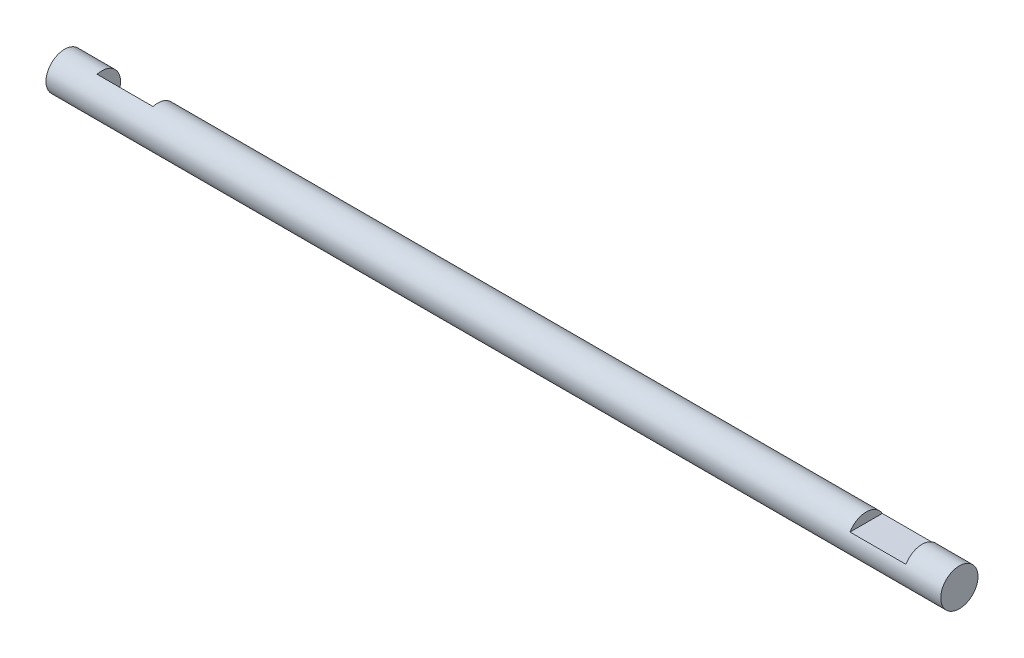
ISO-10303-21;
HEADER;
FILE_DESCRIPTION(('STEP AP214'),'2;1');
FILE_NAME('part.step','',(''),(''),'','','');
FILE_SCHEMA(('AUTOMOTIVE_DESIGN { 1 0 10303 214 1 1 1 1 }'));
ENDSEC;
DATA;
#1=APPLICATION_CONTEXT('core data for automotive mechanical design processes');
#2=APPLICATION_PROTOCOL_DEFINITION('international standard','automotive_design',2000,#1);
#3=PRODUCT_CONTEXT('',#1,'mechanical');
#4=PRODUCT('Part','Part','',(#3));
#5=PRODUCT_RELATED_PRODUCT_CATEGORY('part','',(#4));
#6=PRODUCT_DEFINITION_FORMATION('','',#4);
#7=PRODUCT_DEFINITION_CONTEXT('part definition',#1,'design');
#8=PRODUCT_DEFINITION('design','',#6,#7);
#9=PRODUCT_DEFINITION_SHAPE('','',#8);
#10=(LENGTH_UNIT() NAMED_UNIT(*) SI_UNIT(.MILLI.,.METRE.));
#11=(NAMED_UNIT(*) PLANE_ANGLE_UNIT() SI_UNIT($,.RADIAN.));
#12=(NAMED_UNIT(*) SI_UNIT($,.STERADIAN.) SOLID_ANGLE_UNIT());
#13=UNCERTAINTY_MEASURE_WITH_UNIT(LENGTH_MEASURE(1.E-05),#10,'distance_accuracy_value','');
#14=(GEOMETRIC_REPRESENTATION_CONTEXT(3) GLOBAL_UNCERTAINTY_ASSIGNED_CONTEXT((#13)) GLOBAL_UNIT_ASSIGNED_CONTEXT((#10,
#11,#12)) REPRESENTATION_CONTEXT('',''));
#15=CARTESIAN_POINT('',(0.,0.,0.));
#16=DIRECTION('',(0.,0.,1.));
#17=DIRECTION('',(1.,0.,0.));
#18=AXIS2_PLACEMENT_3D('',#15,#16,#17);
#19=CARTESIAN_POINT('',(152.4,0.,0.));
#20=DIRECTION('',(-1.,0.,0.));
#21=DIRECTION('',(0.,0.,1.));
#22=AXIS2_PLACEMENT_3D('',#19,#20,#21);
#23=CYLINDRICAL_SURFACE('',#22,6.35);
#24=CARTESIAN_POINT('',(-152.4,0.,0.));
#25=DIRECTION('',(1.,0.,0.));
#26=DIRECTION('',(0.,0.,-1.));
#27=AXIS2_PLACEMENT_3D('',#24,#25,#26);
#28=CIRCLE('',#27,6.35);
#29=CARTESIAN_POINT('',(-152.4,0.,-6.35));
#30=VERTEX_POINT('',#29);
#31=EDGE_CURVE('E108',#30,#30,#28,.T.);
#32=ORIENTED_EDGE('',*,*,#31,.T.);
#33=EDGE_LOOP('',(#32));
#34=FACE_BOUND('',#33,.T.);
#35=CARTESIAN_POINT('',(152.4,0.,0.));
#36=DIRECTION('',(1.,0.,0.));
#37=DIRECTION('',(0.,0.,-1.));
#38=AXIS2_PLACEMENT_3D('',#35,#36,#37);
#39=CIRCLE('',#38,6.35);
#40=CARTESIAN_POINT('',(152.4,0.,-6.35));
#41=VERTEX_POINT('',#40);
#42=EDGE_CURVE('E107',#41,#41,#39,.T.);
#43=ORIENTED_EDGE('',*,*,#42,.F.);
#44=EDGE_LOOP('',(#43));
#45=FACE_BOUND('',#44,.T.);
#46=DIRECTION('',(-1.,0.,0.));
#47=VECTOR('',#46,1.);
#48=CARTESIAN_POINT('',(152.4,3.175,-5.49926131403118));
#49=LINE('',#48,#47);
#50=CARTESIAN_POINT('',(139.7,3.175,-5.49926131403118));
#51=VERTEX_POINT('',#50);
#52=CARTESIAN_POINT('',(120.65,3.175,-5.49926131403118));
#53=VERTEX_POINT('',#52);
#54=EDGE_CURVE('E97',#51,#53,#49,.T.);
#55=ORIENTED_EDGE('',*,*,#54,.F.);
#56=CARTESIAN_POINT('',(139.7,0.,0.));
#57=DIRECTION('',(1.,0.,0.));
#58=DIRECTION('',(0.,0.,-1.));
#59=AXIS2_PLACEMENT_3D('',#56,#57,#58);
#60=CIRCLE('',#59,6.35);
#61=CARTESIAN_POINT('',(139.7,3.175,5.49926131403118));
#62=VERTEX_POINT('',#61);
#63=EDGE_CURVE('E103',#51,#62,#60,.T.);
#64=ORIENTED_EDGE('',*,*,#63,.T.);
#65=DIRECTION('',(-1.,0.,0.));
#66=VECTOR('',#65,1.);
#67=CARTESIAN_POINT('',(152.4,3.175,5.49926131403118));
#68=LINE('',#67,#66);
#69=CARTESIAN_POINT('',(120.65,3.175,5.49926131403118));
#70=VERTEX_POINT('',#69);
#71=EDGE_CURVE('E99',#70,#62,#68,.F.);
#72=ORIENTED_EDGE('',*,*,#71,.F.);
#73=CARTESIAN_POINT('',(120.65,0.,0.));
#74=DIRECTION('',(-1.,0.,0.));
#75=DIRECTION('',(0.,0.,1.));
#76=AXIS2_PLACEMENT_3D('',#73,#74,#75);
#77=CIRCLE('',#76,6.35);
#78=EDGE_CURVE('E65',#70,#53,#77,.T.);
#79=ORIENTED_EDGE('',*,*,#78,.T.);
#80=EDGE_LOOP('',(#55,#64,#72,#79));
#81=FACE_BOUND('',#80,.T.);
#82=DIRECTION('',(-1.,0.,0.));
#83=VECTOR('',#82,1.);
#84=CARTESIAN_POINT('',(152.4,6.13362899693558,1.64350093640102));
#85=LINE('',#84,#83);
#86=CARTESIAN_POINT('',(-120.65,6.13362899693559,1.64350093640101));
#87=VERTEX_POINT('',#86);
#88=CARTESIAN_POINT('',(-139.7,6.13362899693559,1.64350093640101));
#89=VERTEX_POINT('',#88);
#90=EDGE_CURVE('E13',#87,#89,#85,.T.);
#91=ORIENTED_EDGE('',*,*,#90,.T.);
#92=CARTESIAN_POINT('',(-139.7,0.,0.));
#93=DIRECTION('',(1.,0.,0.));
#94=DIRECTION('',(0.,0.,-1.));
#95=AXIS2_PLACEMENT_3D('',#92,#93,#94);
#96=CIRCLE('',#95,6.35);
#97=CARTESIAN_POINT('',(-139.7,-1.64350093640101,-6.13362899693559));
#98=VERTEX_POINT('',#97);
#99=EDGE_CURVE('E86',#98,#89,#96,.T.);
#100=ORIENTED_EDGE('',*,*,#99,.F.);
#101=DIRECTION('',(-1.,0.,0.));
#102=VECTOR('',#101,1.);
#103=CARTESIAN_POINT('',(152.4,-1.64350093640103,-6.13362899693558));
#104=LINE('',#103,#102);
#105=CARTESIAN_POINT('',(-120.65,-1.64350093640101,-6.13362899693558));
#106=VERTEX_POINT('',#105);
#107=EDGE_CURVE('E51',#98,#106,#104,.F.);
#108=ORIENTED_EDGE('',*,*,#107,.T.);
#109=CARTESIAN_POINT('',(-120.65,0.,0.));
#110=DIRECTION('',(-1.,0.,0.));
#111=DIRECTION('',(0.,0.,1.));
#112=AXIS2_PLACEMENT_3D('',#109,#110,#111);
#113=CIRCLE('',#112,6.35);
#114=EDGE_CURVE('E92',#87,#106,#113,.T.);
#115=ORIENTED_EDGE('',*,*,#114,.F.);
#116=EDGE_LOOP('',(#91,#100,#108,#115));
#117=FACE_BOUND('',#116,.T.);
#118=ADVANCED_FACE('F44',(#34,#45,#81,#117),#23,.T.);
#119=CARTESIAN_POINT('',(152.4,0.,0.));
#120=DIRECTION('',(1.,0.,0.));
#121=DIRECTION('',(0.,0.,-1.));
#122=AXIS2_PLACEMENT_3D('',#119,#120,#121);
#123=PLANE('',#122);
#124=ORIENTED_EDGE('',*,*,#42,.T.);
#125=EDGE_LOOP('',(#124));
#126=FACE_BOUND('',#125,.T.);
#127=ADVANCED_FACE('F129',(#126),#123,.T.);
#128=CARTESIAN_POINT('',(-152.4,0.,0.));
#129=DIRECTION('',(1.,0.,0.));
#130=DIRECTION('',(0.,0.,-1.));
#131=AXIS2_PLACEMENT_3D('',#128,#129,#130);
#132=PLANE('',#131);
#133=ORIENTED_EDGE('',*,*,#31,.F.);
#134=EDGE_LOOP('',(#133));
#135=FACE_BOUND('',#134,.T.);
#136=ADVANCED_FACE('F134',(#135),#132,.F.);
#137=CARTESIAN_POINT('',(139.7,3.175,6.35));
#138=DIRECTION('',(1.,0.,0.));
#139=DIRECTION('',(0.,0.,-1.));
#140=AXIS2_PLACEMENT_3D('',#137,#138,#139);
#141=PLANE('',#140);
#142=DIRECTION('',(0.,0.,-1.));
#143=VECTOR('',#142,1.);
#144=CARTESIAN_POINT('',(139.7,3.175,6.35));
#145=LINE('',#144,#143);
#146=EDGE_CURVE('E115',#62,#51,#145,.T.);
#147=ORIENTED_EDGE('',*,*,#146,.F.);
#148=ORIENTED_EDGE('',*,*,#63,.F.);
#149=EDGE_LOOP('',(#147,#148));
#150=FACE_BOUND('',#149,.T.);
#151=ADVANCED_FACE('F147',(#150),#141,.F.);
#152=CARTESIAN_POINT('',(120.65,3.175,-6.35));
#153=DIRECTION('',(-1.,0.,0.));
#154=DIRECTION('',(0.,0.,1.));
#155=AXIS2_PLACEMENT_3D('',#152,#153,#154);
#156=PLANE('',#155);
#157=DIRECTION('',(0.,0.,1.));
#158=VECTOR('',#157,1.);
#159=CARTESIAN_POINT('',(120.65,3.175,-6.35));
#160=LINE('',#159,#158);
#161=EDGE_CURVE('E111',#53,#70,#160,.T.);
#162=ORIENTED_EDGE('',*,*,#161,.F.);
#163=ORIENTED_EDGE('',*,*,#78,.F.);
#164=EDGE_LOOP('',(#162,#163));
#165=FACE_BOUND('',#164,.T.);
#166=ADVANCED_FACE('F145',(#165),#156,.F.);
#167=CARTESIAN_POINT('',(0.,3.175,0.));
#168=DIRECTION('',(0.,1.,0.));
#169=DIRECTION('',(0.,0.,1.));
#170=AXIS2_PLACEMENT_3D('',#167,#168,#169);
#171=PLANE('',#170);
#172=ORIENTED_EDGE('',*,*,#54,.T.);
#173=ORIENTED_EDGE('',*,*,#161,.T.);
#174=ORIENTED_EDGE('',*,*,#71,.T.);
#175=ORIENTED_EDGE('',*,*,#146,.T.);
#176=EDGE_LOOP('',(#172,#173,#174,#175));
#177=FACE_BOUND('',#176,.T.);
#178=ADVANCED_FACE('F126',(#177),#171,.T.);
#179=CARTESIAN_POINT('',(-139.7,-2.24506403026729,-6.73519209080187));
#180=DIRECTION('',(1.,0.,0.));
#181=DIRECTION('',(0.,0.,-1.));
#182=AXIS2_PLACEMENT_3D('',#179,#180,#181);
#183=PLANE('',#182);
#184=ORIENTED_EDGE('',*,*,#99,.T.);
#185=DIRECTION('',(0.,-0.707106781186548,-0.707106781186547));
#186=VECTOR('',#185,1.);
#187=CARTESIAN_POINT('',(-139.7,-2.24506403026729,-6.73519209080187));
#188=LINE('',#187,#186);
#189=EDGE_CURVE('E89',#89,#98,#188,.T.);
#190=ORIENTED_EDGE('',*,*,#189,.T.);
#191=EDGE_LOOP('',(#184,#190));
#192=FACE_BOUND('',#191,.T.);
#193=ADVANCED_FACE('F88',(#192),#183,.T.);
#194=CARTESIAN_POINT('',(-120.65,-2.24506403026729,-6.73519209080187));
#195=DIRECTION('',(-1.,0.,0.));
#196=DIRECTION('',(0.,0.,1.));
#197=AXIS2_PLACEMENT_3D('',#194,#195,#196);
#198=PLANE('',#197);
#199=DIRECTION('',(0.,0.707106781186548,0.707106781186547));
#200=VECTOR('',#199,1.);
#201=CARTESIAN_POINT('',(-120.65,-2.24506403026729,-6.73519209080187));
#202=LINE('',#201,#200);
#203=EDGE_CURVE('E58',#106,#87,#202,.T.);
#204=ORIENTED_EDGE('',*,*,#203,.T.);
#205=ORIENTED_EDGE('',*,*,#114,.T.);
#206=EDGE_LOOP('',(#204,#205));
#207=FACE_BOUND('',#206,.T.);
#208=ADVANCED_FACE('F118',(#207),#198,.T.);
#209=CARTESIAN_POINT('',(0.,2.24506403026728,-2.24506403026728));
#210=DIRECTION('',(0.,-0.707106781186547,0.707106781186548));
#211=DIRECTION('',(0.,-0.707106781186548,-0.707106781186547));
#212=AXIS2_PLACEMENT_3D('',#209,#210,#211);
#213=PLANE('',#212);
#214=ORIENTED_EDGE('',*,*,#203,.F.);
#215=ORIENTED_EDGE('',*,*,#107,.F.);
#216=ORIENTED_EDGE('',*,*,#189,.F.);
#217=ORIENTED_EDGE('',*,*,#90,.F.);
#218=EDGE_LOOP('',(#214,#215,#216,#217));
#219=FACE_BOUND('',#218,.T.);
#220=ADVANCED_FACE('F94',(#219),#213,.F.);
#221=CLOSED_SHELL('',(#118,#127,#136,#151,#166,#178,#193,#208,#220));
#222=MANIFOLD_SOLID_BREP('B2',#221);
#223=ADVANCED_BREP_SHAPE_REPRESENTATION('',(#18,#222),#14);
#224=SHAPE_DEFINITION_REPRESENTATION(#9,#223);
ENDSEC;
END-ISO-10303-21;
